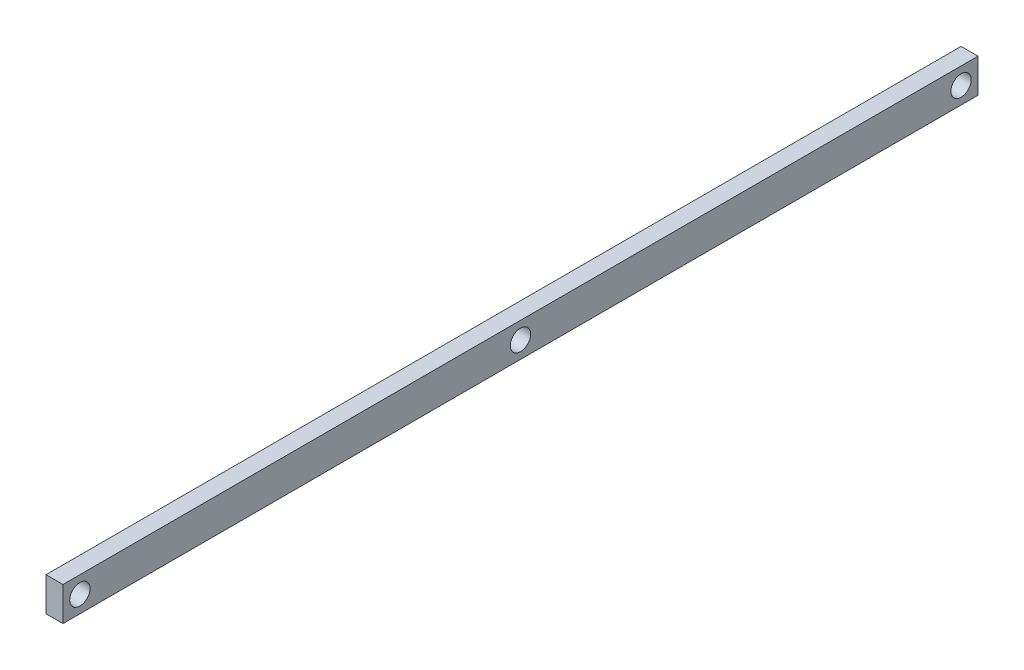
ISO-10303-21;
HEADER;
FILE_DESCRIPTION(('STEP AP214'),'2;1');
FILE_NAME('part.step','',(''),(''),'','','');
FILE_SCHEMA(('AUTOMOTIVE_DESIGN { 1 0 10303 214 1 1 1 1 }'));
ENDSEC;
DATA;
#1=APPLICATION_CONTEXT('core data for automotive mechanical design processes');
#2=APPLICATION_PROTOCOL_DEFINITION('international standard','automotive_design',2000,#1);
#3=PRODUCT_CONTEXT('',#1,'mechanical');
#4=PRODUCT('Part','Part','',(#3));
#5=PRODUCT_RELATED_PRODUCT_CATEGORY('part','',(#4));
#6=PRODUCT_DEFINITION_FORMATION('','',#4);
#7=PRODUCT_DEFINITION_CONTEXT('part definition',#1,'design');
#8=PRODUCT_DEFINITION('design','',#6,#7);
#9=PRODUCT_DEFINITION_SHAPE('','',#8);
#10=(LENGTH_UNIT() NAMED_UNIT(*) SI_UNIT(.MILLI.,.METRE.));
#11=(NAMED_UNIT(*) PLANE_ANGLE_UNIT() SI_UNIT($,.RADIAN.));
#12=(NAMED_UNIT(*) SI_UNIT($,.STERADIAN.) SOLID_ANGLE_UNIT());
#13=UNCERTAINTY_MEASURE_WITH_UNIT(LENGTH_MEASURE(1.E-05),#10,'distance_accuracy_value','');
#14=(GEOMETRIC_REPRESENTATION_CONTEXT(3) GLOBAL_UNCERTAINTY_ASSIGNED_CONTEXT((#13)) GLOBAL_UNIT_ASSIGNED_CONTEXT((#10,
#11,#12)) REPRESENTATION_CONTEXT('',''));
#15=CARTESIAN_POINT('',(0.,0.,0.));
#16=DIRECTION('',(0.,0.,1.));
#17=DIRECTION('',(1.,0.,0.));
#18=AXIS2_PLACEMENT_3D('',#15,#16,#17);
#19=CARTESIAN_POINT('',(5.,-5.,-135.));
#20=DIRECTION('',(0.,0.,1.));
#21=DIRECTION('',(1.,0.,0.));
#22=AXIS2_PLACEMENT_3D('',#19,#20,#21);
#23=PLANE('',#22);
#24=DIRECTION('',(0.,1.,0.));
#25=VECTOR('',#24,1.);
#26=CARTESIAN_POINT('',(0.,-5.,-135.));
#27=LINE('',#26,#25);
#28=CARTESIAN_POINT('',(0.,-5.,-135.));
#29=VERTEX_POINT('',#28);
#30=CARTESIAN_POINT('',(0.,5.,-135.));
#31=VERTEX_POINT('',#30);
#32=EDGE_CURVE('E96',#29,#31,#27,.T.);
#33=ORIENTED_EDGE('',*,*,#32,.T.);
#34=DIRECTION('',(-1.,0.,0.));
#35=VECTOR('',#34,1.);
#36=CARTESIAN_POINT('',(5.,5.,-135.));
#37=LINE('',#36,#35);
#38=CARTESIAN_POINT('',(5.,5.,-135.));
#39=VERTEX_POINT('',#38);
#40=EDGE_CURVE('E11',#39,#31,#37,.T.);
#41=ORIENTED_EDGE('',*,*,#40,.F.);
#42=DIRECTION('',(0.,1.,0.));
#43=VECTOR('',#42,1.);
#44=CARTESIAN_POINT('',(5.,-5.,-135.));
#45=LINE('',#44,#43);
#46=CARTESIAN_POINT('',(5.,-5.,-135.));
#47=VERTEX_POINT('',#46);
#48=EDGE_CURVE('E84',#47,#39,#45,.T.);
#49=ORIENTED_EDGE('',*,*,#48,.F.);
#50=DIRECTION('',(-1.,0.,0.));
#51=VECTOR('',#50,1.);
#52=CARTESIAN_POINT('',(5.,-5.,-135.));
#53=LINE('',#52,#51);
#54=EDGE_CURVE('E92',#47,#29,#53,.T.);
#55=ORIENTED_EDGE('',*,*,#54,.T.);
#56=EDGE_LOOP('',(#33,#41,#49,#55));
#57=FACE_BOUND('',#56,.T.);
#58=ADVANCED_FACE('F33',(#57),#23,.F.);
#59=CARTESIAN_POINT('',(5.,5.,135.));
#60=DIRECTION('',(0.,-1.,0.));
#61=DIRECTION('',(0.,0.,-1.));
#62=AXIS2_PLACEMENT_3D('',#59,#60,#61);
#63=PLANE('',#62);
#64=DIRECTION('',(0.,0.,1.));
#65=VECTOR('',#64,1.);
#66=CARTESIAN_POINT('',(0.,5.,135.));
#67=LINE('',#66,#65);
#68=CARTESIAN_POINT('',(0.,5.,135.));
#69=VERTEX_POINT('',#68);
#70=EDGE_CURVE('E88',#31,#69,#67,.T.);
#71=ORIENTED_EDGE('',*,*,#70,.T.);
#72=DIRECTION('',(-1.,0.,0.));
#73=VECTOR('',#72,1.);
#74=CARTESIAN_POINT('',(5.,5.,135.));
#75=LINE('',#74,#73);
#76=CARTESIAN_POINT('',(5.,5.,135.));
#77=VERTEX_POINT('',#76);
#78=EDGE_CURVE('E41',#77,#69,#75,.T.);
#79=ORIENTED_EDGE('',*,*,#78,.F.);
#80=DIRECTION('',(0.,0.,1.));
#81=VECTOR('',#80,1.);
#82=CARTESIAN_POINT('',(5.,5.,135.));
#83=LINE('',#82,#81);
#84=EDGE_CURVE('E79',#39,#77,#83,.T.);
#85=ORIENTED_EDGE('',*,*,#84,.F.);
#86=ORIENTED_EDGE('',*,*,#40,.T.);
#87=EDGE_LOOP('',(#71,#79,#85,#86));
#88=FACE_BOUND('',#87,.T.);
#89=ADVANCED_FACE('F87',(#88),#63,.F.);
#90=CARTESIAN_POINT('',(5.,-5.,135.));
#91=DIRECTION('',(0.,0.,-1.));
#92=DIRECTION('',(-1.,0.,0.));
#93=AXIS2_PLACEMENT_3D('',#90,#91,#92);
#94=PLANE('',#93);
#95=DIRECTION('',(0.,-1.,0.));
#96=VECTOR('',#95,1.);
#97=CARTESIAN_POINT('',(0.,-5.,135.));
#98=LINE('',#97,#96);
#99=CARTESIAN_POINT('',(0.,-5.,135.));
#100=VERTEX_POINT('',#99);
#101=EDGE_CURVE('E66',#69,#100,#98,.T.);
#102=ORIENTED_EDGE('',*,*,#101,.T.);
#103=DIRECTION('',(-1.,0.,0.));
#104=VECTOR('',#103,1.);
#105=CARTESIAN_POINT('',(5.,-5.,135.));
#106=LINE('',#105,#104);
#107=CARTESIAN_POINT('',(5.,-5.,135.));
#108=VERTEX_POINT('',#107);
#109=EDGE_CURVE('E89',#108,#100,#106,.T.);
#110=ORIENTED_EDGE('',*,*,#109,.F.);
#111=DIRECTION('',(0.,-1.,0.));
#112=VECTOR('',#111,1.);
#113=CARTESIAN_POINT('',(5.,-5.,135.));
#114=LINE('',#113,#112);
#115=EDGE_CURVE('E82',#77,#108,#114,.T.);
#116=ORIENTED_EDGE('',*,*,#115,.F.);
#117=ORIENTED_EDGE('',*,*,#78,.T.);
#118=EDGE_LOOP('',(#102,#110,#116,#117));
#119=FACE_BOUND('',#118,.T.);
#120=ADVANCED_FACE('F90',(#119),#94,.F.);
#121=CARTESIAN_POINT('',(5.,-5.,135.));
#122=DIRECTION('',(0.,1.,0.));
#123=DIRECTION('',(0.,0.,1.));
#124=AXIS2_PLACEMENT_3D('',#121,#122,#123);
#125=PLANE('',#124);
#126=DIRECTION('',(0.,0.,-1.));
#127=VECTOR('',#126,1.);
#128=CARTESIAN_POINT('',(0.,-5.,135.));
#129=LINE('',#128,#127);
#130=EDGE_CURVE('E72',#100,#29,#129,.T.);
#131=ORIENTED_EDGE('',*,*,#130,.T.);
#132=ORIENTED_EDGE('',*,*,#54,.F.);
#133=DIRECTION('',(0.,0.,-1.));
#134=VECTOR('',#133,1.);
#135=CARTESIAN_POINT('',(5.,-5.,135.));
#136=LINE('',#135,#134);
#137=EDGE_CURVE('E49',#108,#47,#136,.T.);
#138=ORIENTED_EDGE('',*,*,#137,.F.);
#139=ORIENTED_EDGE('',*,*,#109,.T.);
#140=EDGE_LOOP('',(#131,#132,#138,#139));
#141=FACE_BOUND('',#140,.T.);
#142=ADVANCED_FACE('F104',(#141),#125,.F.);
#143=CARTESIAN_POINT('',(5.,0.,0.));
#144=DIRECTION('',(-1.,0.,0.));
#145=DIRECTION('',(0.,0.,1.));
#146=AXIS2_PLACEMENT_3D('',#143,#144,#145);
#147=PLANE('',#146);
#148=CARTESIAN_POINT('',(5.,-9.07785148099215E-13,130.));
#149=DIRECTION('',(1.,0.,0.));
#150=DIRECTION('',(0.,0.,-1.));
#151=AXIS2_PLACEMENT_3D('',#148,#149,#150);
#152=CIRCLE('',#151,2.99999999999999);
#153=CARTESIAN_POINT('',(5.,-9.07785148099215E-13,127.));
#154=VERTEX_POINT('',#153);
#155=EDGE_CURVE('E124',#154,#154,#152,.T.);
#156=ORIENTED_EDGE('',*,*,#155,.F.);
#157=EDGE_LOOP('',(#156));
#158=FACE_BOUND('',#157,.T.);
#159=CARTESIAN_POINT('',(5.,0.,-130.));
#160=DIRECTION('',(1.,0.,0.));
#161=DIRECTION('',(0.,0.,-1.));
#162=AXIS2_PLACEMENT_3D('',#159,#160,#161);
#163=CIRCLE('',#162,2.99999999999999);
#164=CARTESIAN_POINT('',(5.,0.,-133.));
#165=VERTEX_POINT('',#164);
#166=EDGE_CURVE('E118',#165,#165,#163,.T.);
#167=ORIENTED_EDGE('',*,*,#166,.F.);
#168=EDGE_LOOP('',(#167));
#169=FACE_BOUND('',#168,.T.);
#170=CARTESIAN_POINT('',(5.,0.,0.));
#171=DIRECTION('',(1.,0.,0.));
#172=DIRECTION('',(0.,0.,-1.));
#173=AXIS2_PLACEMENT_3D('',#170,#171,#172);
#174=CIRCLE('',#173,3.);
#175=CARTESIAN_POINT('',(5.,0.,-3.));
#176=VERTEX_POINT('',#175);
#177=EDGE_CURVE('E112',#176,#176,#174,.T.);
#178=ORIENTED_EDGE('',*,*,#177,.F.);
#179=EDGE_LOOP('',(#178));
#180=FACE_BOUND('',#179,.T.);
#181=ORIENTED_EDGE('',*,*,#48,.T.);
#182=ORIENTED_EDGE('',*,*,#84,.T.);
#183=ORIENTED_EDGE('',*,*,#115,.T.);
#184=ORIENTED_EDGE('',*,*,#137,.T.);
#185=EDGE_LOOP('',(#181,#182,#183,#184));
#186=FACE_BOUND('',#185,.T.);
#187=ADVANCED_FACE('F80',(#158,#169,#180,#186),#147,.F.);
#188=CARTESIAN_POINT('',(0.,0.,0.));
#189=DIRECTION('',(-1.,0.,0.));
#190=DIRECTION('',(0.,0.,1.));
#191=AXIS2_PLACEMENT_3D('',#188,#189,#190);
#192=PLANE('',#191);
#193=CARTESIAN_POINT('',(0.,-9.07785148099215E-13,130.));
#194=DIRECTION('',(-1.,0.,0.));
#195=DIRECTION('',(0.,0.,1.));
#196=AXIS2_PLACEMENT_3D('',#193,#194,#195);
#197=CIRCLE('',#196,2.99999999999999);
#198=CARTESIAN_POINT('',(0.,-9.07785148099215E-13,133.));
#199=VERTEX_POINT('',#198);
#200=EDGE_CURVE('E121',#199,#199,#197,.F.);
#201=ORIENTED_EDGE('',*,*,#200,.T.);
#202=EDGE_LOOP('',(#201));
#203=FACE_BOUND('',#202,.T.);
#204=CARTESIAN_POINT('',(0.,0.,-130.));
#205=DIRECTION('',(-1.,0.,0.));
#206=DIRECTION('',(0.,0.,1.));
#207=AXIS2_PLACEMENT_3D('',#204,#205,#206);
#208=CIRCLE('',#207,2.99999999999999);
#209=CARTESIAN_POINT('',(0.,0.,-127.));
#210=VERTEX_POINT('',#209);
#211=EDGE_CURVE('E115',#210,#210,#208,.F.);
#212=ORIENTED_EDGE('',*,*,#211,.T.);
#213=EDGE_LOOP('',(#212));
#214=FACE_BOUND('',#213,.T.);
#215=CARTESIAN_POINT('',(0.,0.,0.));
#216=DIRECTION('',(-1.,0.,0.));
#217=DIRECTION('',(0.,0.,1.));
#218=AXIS2_PLACEMENT_3D('',#215,#216,#217);
#219=CIRCLE('',#218,3.);
#220=CARTESIAN_POINT('',(0.,0.,3.));
#221=VERTEX_POINT('',#220);
#222=EDGE_CURVE('E99',#221,#221,#219,.F.);
#223=ORIENTED_EDGE('',*,*,#222,.T.);
#224=EDGE_LOOP('',(#223));
#225=FACE_BOUND('',#224,.T.);
#226=ORIENTED_EDGE('',*,*,#32,.F.);
#227=ORIENTED_EDGE('',*,*,#130,.F.);
#228=ORIENTED_EDGE('',*,*,#101,.F.);
#229=ORIENTED_EDGE('',*,*,#70,.F.);
#230=EDGE_LOOP('',(#226,#227,#228,#229));
#231=FACE_BOUND('',#230,.T.);
#232=ADVANCED_FACE('F107',(#203,#214,#225,#231),#192,.T.);
#233=CARTESIAN_POINT('',(-8.48528137423857,0.,0.));
#234=DIRECTION('',(1.,0.,0.));
#235=DIRECTION('',(0.,0.,-1.));
#236=AXIS2_PLACEMENT_3D('',#233,#234,#235);
#237=CYLINDRICAL_SURFACE('',#236,3.);
#238=ORIENTED_EDGE('',*,*,#177,.T.);
#239=EDGE_LOOP('',(#238));
#240=FACE_BOUND('',#239,.T.);
#241=ORIENTED_EDGE('',*,*,#222,.F.);
#242=EDGE_LOOP('',(#241));
#243=FACE_BOUND('',#242,.T.);
#244=ADVANCED_FACE('F138',(#240,#243),#237,.F.);
#245=CARTESIAN_POINT('',(-8.48528137423857,0.,-130.));
#246=DIRECTION('',(1.,0.,0.));
#247=DIRECTION('',(0.,0.,-1.));
#248=AXIS2_PLACEMENT_3D('',#245,#246,#247);
#249=CYLINDRICAL_SURFACE('',#248,2.99999999999999);
#250=ORIENTED_EDGE('',*,*,#166,.T.);
#251=EDGE_LOOP('',(#250));
#252=FACE_BOUND('',#251,.T.);
#253=ORIENTED_EDGE('',*,*,#211,.F.);
#254=EDGE_LOOP('',(#253));
#255=FACE_BOUND('',#254,.T.);
#256=ADVANCED_FACE('F141',(#252,#255),#249,.F.);
#257=CARTESIAN_POINT('',(-8.48528137423857,-9.07785148099215E-13,130.));
#258=DIRECTION('',(1.,0.,0.));
#259=DIRECTION('',(0.,0.,-1.));
#260=AXIS2_PLACEMENT_3D('',#257,#258,#259);
#261=CYLINDRICAL_SURFACE('',#260,2.99999999999999);
#262=ORIENTED_EDGE('',*,*,#155,.T.);
#263=EDGE_LOOP('',(#262));
#264=FACE_BOUND('',#263,.T.);
#265=ORIENTED_EDGE('',*,*,#200,.F.);
#266=EDGE_LOOP('',(#265));
#267=FACE_BOUND('',#266,.T.);
#268=ADVANCED_FACE('F128',(#264,#267),#261,.F.);
#269=CLOSED_SHELL('',(#58,#89,#120,#142,#187,#232,#244,#256,#268));
#270=MANIFOLD_SOLID_BREP('B2',#269);
#271=ADVANCED_BREP_SHAPE_REPRESENTATION('',(#18,#270),#14);
#272=SHAPE_DEFINITION_REPRESENTATION(#9,#271);
ENDSEC;
END-ISO-10303-21;
